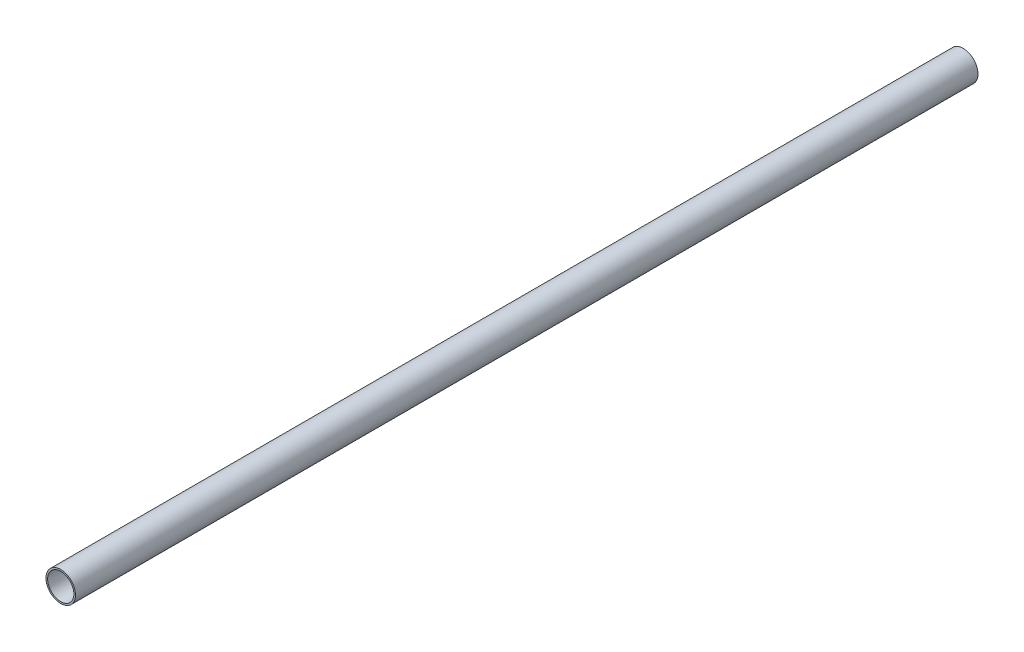
ISO-10303-21;
HEADER;
FILE_DESCRIPTION(('STEP AP214'),'2;1');
FILE_NAME('part.step','',(''),(''),'','','');
FILE_SCHEMA(('AUTOMOTIVE_DESIGN { 1 0 10303 214 1 1 1 1 }'));
ENDSEC;
DATA;
#1=APPLICATION_CONTEXT('core data for automotive mechanical design processes');
#2=APPLICATION_PROTOCOL_DEFINITION('international standard','automotive_design',2000,#1);
#3=PRODUCT_CONTEXT('',#1,'mechanical');
#4=PRODUCT('Part','Part','',(#3));
#5=PRODUCT_RELATED_PRODUCT_CATEGORY('part','',(#4));
#6=PRODUCT_DEFINITION_FORMATION('','',#4);
#7=PRODUCT_DEFINITION_CONTEXT('part definition',#1,'design');
#8=PRODUCT_DEFINITION('design','',#6,#7);
#9=PRODUCT_DEFINITION_SHAPE('','',#8);
#10=(LENGTH_UNIT() NAMED_UNIT(*) SI_UNIT(.MILLI.,.METRE.));
#11=(NAMED_UNIT(*) PLANE_ANGLE_UNIT() SI_UNIT($,.RADIAN.));
#12=(NAMED_UNIT(*) SI_UNIT($,.STERADIAN.) SOLID_ANGLE_UNIT());
#13=UNCERTAINTY_MEASURE_WITH_UNIT(LENGTH_MEASURE(1.E-05),#10,'distance_accuracy_value','');
#14=(GEOMETRIC_REPRESENTATION_CONTEXT(3) GLOBAL_UNCERTAINTY_ASSIGNED_CONTEXT((#13)) GLOBAL_UNIT_ASSIGNED_CONTEXT((#10,
#11,#12)) REPRESENTATION_CONTEXT('',''));
#15=CARTESIAN_POINT('',(0.,0.,0.));
#16=DIRECTION('',(0.,0.,1.));
#17=DIRECTION('',(1.,0.,0.));
#18=AXIS2_PLACEMENT_3D('',#15,#16,#17);
#19=CARTESIAN_POINT('',(0.,0.,550.));
#20=DIRECTION('',(0.,0.,1.));
#21=DIRECTION('',(1.,0.,0.));
#22=AXIS2_PLACEMENT_3D('',#19,#20,#21);
#23=PLANE('',#22);
#24=CARTESIAN_POINT('',(0.,0.,550.));
#25=DIRECTION('',(0.,0.,1.));
#26=DIRECTION('',(1.,0.,0.));
#27=AXIS2_PLACEMENT_3D('',#24,#25,#26);
#28=CIRCLE('',#27,9.);
#29=CARTESIAN_POINT('',(9.,0.,550.));
#30=VERTEX_POINT('',#29);
#31=EDGE_CURVE('E10',#30,#30,#28,.T.);
#32=ORIENTED_EDGE('',*,*,#31,.T.);
#33=EDGE_LOOP('',(#32));
#34=FACE_BOUND('',#33,.T.);
#35=CARTESIAN_POINT('',(0.,0.,550.));
#36=DIRECTION('',(0.,0.,1.));
#37=DIRECTION('',(1.,0.,0.));
#38=AXIS2_PLACEMENT_3D('',#35,#36,#37);
#39=CIRCLE('',#38,8.);
#40=CARTESIAN_POINT('',(8.,0.,550.));
#41=VERTEX_POINT('',#40);
#42=EDGE_CURVE('E50',#41,#41,#39,.T.);
#43=ORIENTED_EDGE('',*,*,#42,.F.);
#44=EDGE_LOOP('',(#43));
#45=FACE_BOUND('',#44,.T.);
#46=ADVANCED_FACE('F39',(#34,#45),#23,.T.);
#47=CARTESIAN_POINT('',(0.,0.,0.));
#48=DIRECTION('',(0.,0.,1.));
#49=DIRECTION('',(1.,0.,0.));
#50=AXIS2_PLACEMENT_3D('',#47,#48,#49);
#51=PLANE('',#50);
#52=CARTESIAN_POINT('',(0.,0.,0.));
#53=DIRECTION('',(0.,0.,1.));
#54=DIRECTION('',(1.,0.,0.));
#55=AXIS2_PLACEMENT_3D('',#52,#53,#54);
#56=CIRCLE('',#55,9.);
#57=CARTESIAN_POINT('',(9.,0.,0.));
#58=VERTEX_POINT('',#57);
#59=EDGE_CURVE('E43',#58,#58,#56,.T.);
#60=ORIENTED_EDGE('',*,*,#59,.F.);
#61=EDGE_LOOP('',(#60));
#62=FACE_BOUND('',#61,.T.);
#63=CARTESIAN_POINT('',(0.,0.,0.));
#64=DIRECTION('',(0.,0.,1.));
#65=DIRECTION('',(1.,0.,0.));
#66=AXIS2_PLACEMENT_3D('',#63,#64,#65);
#67=CIRCLE('',#66,8.);
#68=CARTESIAN_POINT('',(8.,0.,0.));
#69=VERTEX_POINT('',#68);
#70=EDGE_CURVE('E52',#69,#69,#67,.T.);
#71=ORIENTED_EDGE('',*,*,#70,.T.);
#72=EDGE_LOOP('',(#71));
#73=FACE_BOUND('',#72,.T.);
#74=ADVANCED_FACE('F62',(#62,#73),#51,.F.);
#75=CARTESIAN_POINT('',(0.,0.,550.));
#76=DIRECTION('',(0.,0.,-1.));
#77=DIRECTION('',(-1.,0.,0.));
#78=AXIS2_PLACEMENT_3D('',#75,#76,#77);
#79=CYLINDRICAL_SURFACE('',#78,9.);
#80=ORIENTED_EDGE('',*,*,#31,.F.);
#81=EDGE_LOOP('',(#80));
#82=FACE_BOUND('',#81,.T.);
#83=ORIENTED_EDGE('',*,*,#59,.T.);
#84=EDGE_LOOP('',(#83));
#85=FACE_BOUND('',#84,.T.);
#86=ADVANCED_FACE('F41',(#82,#85),#79,.T.);
#87=CARTESIAN_POINT('',(0.,0.,550.));
#88=DIRECTION('',(0.,0.,-1.));
#89=DIRECTION('',(-1.,0.,0.));
#90=AXIS2_PLACEMENT_3D('',#87,#88,#89);
#91=CYLINDRICAL_SURFACE('',#90,8.);
#92=ORIENTED_EDGE('',*,*,#42,.T.);
#93=EDGE_LOOP('',(#92));
#94=FACE_BOUND('',#93,.T.);
#95=ORIENTED_EDGE('',*,*,#70,.F.);
#96=EDGE_LOOP('',(#95));
#97=FACE_BOUND('',#96,.T.);
#98=ADVANCED_FACE('F58',(#94,#97),#91,.F.);
#99=CLOSED_SHELL('',(#46,#74,#86,#98));
#100=MANIFOLD_SOLID_BREP('B2',#99);
#101=ADVANCED_BREP_SHAPE_REPRESENTATION('',(#18,#100),#14);
#102=SHAPE_DEFINITION_REPRESENTATION(#9,#101);
ENDSEC;
END-ISO-10303-21;
